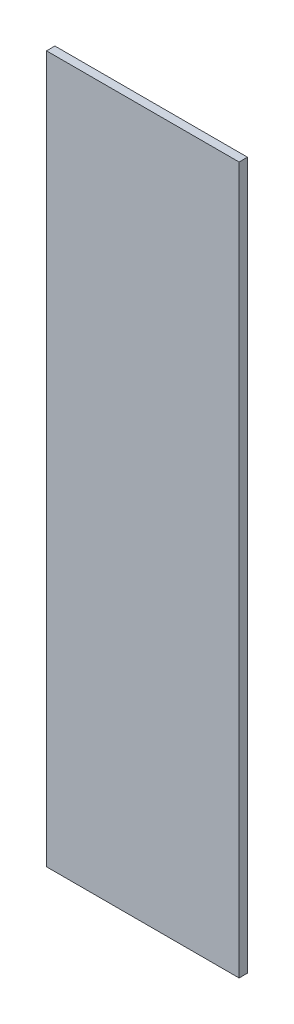
ISO-10303-21;
HEADER;
FILE_DESCRIPTION(('STEP AP214'),'2;1');
FILE_NAME('part.step','',(''),(''),'','','');
FILE_SCHEMA(('AUTOMOTIVE_DESIGN { 1 0 10303 214 1 1 1 1 }'));
ENDSEC;
DATA;
#1=APPLICATION_CONTEXT('core data for automotive mechanical design processes');
#2=APPLICATION_PROTOCOL_DEFINITION('international standard','automotive_design',2000,#1);
#3=PRODUCT_CONTEXT('',#1,'mechanical');
#4=PRODUCT('Part','Part','',(#3));
#5=PRODUCT_RELATED_PRODUCT_CATEGORY('part','',(#4));
#6=PRODUCT_DEFINITION_FORMATION('','',#4);
#7=PRODUCT_DEFINITION_CONTEXT('part definition',#1,'design');
#8=PRODUCT_DEFINITION('design','',#6,#7);
#9=PRODUCT_DEFINITION_SHAPE('','',#8);
#10=(LENGTH_UNIT() NAMED_UNIT(*) SI_UNIT(.MILLI.,.METRE.));
#11=(NAMED_UNIT(*) PLANE_ANGLE_UNIT() SI_UNIT($,.RADIAN.));
#12=(NAMED_UNIT(*) SI_UNIT($,.STERADIAN.) SOLID_ANGLE_UNIT());
#13=UNCERTAINTY_MEASURE_WITH_UNIT(LENGTH_MEASURE(1.E-05),#10,'distance_accuracy_value','');
#14=(GEOMETRIC_REPRESENTATION_CONTEXT(3) GLOBAL_UNCERTAINTY_ASSIGNED_CONTEXT((#13)) GLOBAL_UNIT_ASSIGNED_CONTEXT((#10,
#11,#12)) REPRESENTATION_CONTEXT('',''));
#15=CARTESIAN_POINT('',(0.,0.,0.));
#16=DIRECTION('',(0.,0.,1.));
#17=DIRECTION('',(1.,0.,0.));
#18=AXIS2_PLACEMENT_3D('',#15,#16,#17);
#19=CARTESIAN_POINT('',(0.,0.,3.175));
#20=DIRECTION('',(-1.,0.,0.));
#21=DIRECTION('',(0.,0.,1.));
#22=AXIS2_PLACEMENT_3D('',#19,#20,#21);
#23=PLANE('',#22);
#24=DIRECTION('',(0.,1.,0.));
#25=VECTOR('',#24,1.);
#26=CARTESIAN_POINT('',(0.,0.,0.));
#27=LINE('',#26,#25);
#28=CARTESIAN_POINT('',(0.,0.,0.));
#29=VERTEX_POINT('',#28);
#30=CARTESIAN_POINT('',(0.,267.9,0.));
#31=VERTEX_POINT('',#30);
#32=EDGE_CURVE('E102',#29,#31,#27,.T.);
#33=ORIENTED_EDGE('',*,*,#32,.T.);
#34=DIRECTION('',(0.,0.,-1.));
#35=VECTOR('',#34,1.);
#36=CARTESIAN_POINT('',(0.,267.9,3.175));
#37=LINE('',#36,#35);
#38=CARTESIAN_POINT('',(0.,267.9,3.175));
#39=VERTEX_POINT('',#38);
#40=EDGE_CURVE('E11',#39,#31,#37,.T.);
#41=ORIENTED_EDGE('',*,*,#40,.F.);
#42=DIRECTION('',(0.,1.,0.));
#43=VECTOR('',#42,1.);
#44=CARTESIAN_POINT('',(0.,0.,3.175));
#45=LINE('',#44,#43);
#46=CARTESIAN_POINT('',(0.,0.,3.175));
#47=VERTEX_POINT('',#46);
#48=EDGE_CURVE('E90',#47,#39,#45,.T.);
#49=ORIENTED_EDGE('',*,*,#48,.F.);
#50=DIRECTION('',(0.,0.,-1.));
#51=VECTOR('',#50,1.);
#52=CARTESIAN_POINT('',(0.,0.,3.175));
#53=LINE('',#52,#51);
#54=EDGE_CURVE('E98',#47,#29,#53,.T.);
#55=ORIENTED_EDGE('',*,*,#54,.T.);
#56=EDGE_LOOP('',(#33,#41,#49,#55));
#57=FACE_BOUND('',#56,.T.);
#58=ADVANCED_FACE('F39',(#57),#23,.F.);
#59=CARTESIAN_POINT('',(0.,267.9,3.175));
#60=DIRECTION('',(0.,-1.,0.));
#61=DIRECTION('',(0.,0.,-1.));
#62=AXIS2_PLACEMENT_3D('',#59,#60,#61);
#63=PLANE('',#62);
#64=DIRECTION('',(-1.,0.,0.));
#65=VECTOR('',#64,1.);
#66=CARTESIAN_POINT('',(0.,267.9,0.));
#67=LINE('',#66,#65);
#68=CARTESIAN_POINT('',(-73.,267.9,0.));
#69=VERTEX_POINT('',#68);
#70=EDGE_CURVE('E94',#31,#69,#67,.T.);
#71=ORIENTED_EDGE('',*,*,#70,.T.);
#72=DIRECTION('',(0.,0.,-1.));
#73=VECTOR('',#72,1.);
#74=CARTESIAN_POINT('',(-73.,267.9,3.175));
#75=LINE('',#74,#73);
#76=CARTESIAN_POINT('',(-73.,267.9,3.175));
#77=VERTEX_POINT('',#76);
#78=EDGE_CURVE('E47',#77,#69,#75,.T.);
#79=ORIENTED_EDGE('',*,*,#78,.F.);
#80=DIRECTION('',(-1.,0.,0.));
#81=VECTOR('',#80,1.);
#82=CARTESIAN_POINT('',(0.,267.9,3.175));
#83=LINE('',#82,#81);
#84=EDGE_CURVE('E85',#39,#77,#83,.T.);
#85=ORIENTED_EDGE('',*,*,#84,.F.);
#86=ORIENTED_EDGE('',*,*,#40,.T.);
#87=EDGE_LOOP('',(#71,#79,#85,#86));
#88=FACE_BOUND('',#87,.T.);
#89=ADVANCED_FACE('F93',(#88),#63,.F.);
#90=CARTESIAN_POINT('',(-73.,0.,3.175));
#91=DIRECTION('',(1.,0.,0.));
#92=DIRECTION('',(0.,0.,-1.));
#93=AXIS2_PLACEMENT_3D('',#90,#91,#92);
#94=PLANE('',#93);
#95=DIRECTION('',(0.,-1.,0.));
#96=VECTOR('',#95,1.);
#97=CARTESIAN_POINT('',(-73.,0.,0.));
#98=LINE('',#97,#96);
#99=CARTESIAN_POINT('',(-73.,0.,0.));
#100=VERTEX_POINT('',#99);
#101=EDGE_CURVE('E72',#69,#100,#98,.T.);
#102=ORIENTED_EDGE('',*,*,#101,.T.);
#103=DIRECTION('',(0.,0.,-1.));
#104=VECTOR('',#103,1.);
#105=CARTESIAN_POINT('',(-73.,0.,3.175));
#106=LINE('',#105,#104);
#107=CARTESIAN_POINT('',(-73.,0.,3.175));
#108=VERTEX_POINT('',#107);
#109=EDGE_CURVE('E95',#108,#100,#106,.T.);
#110=ORIENTED_EDGE('',*,*,#109,.F.);
#111=DIRECTION('',(0.,-1.,0.));
#112=VECTOR('',#111,1.);
#113=CARTESIAN_POINT('',(-73.,0.,3.175));
#114=LINE('',#113,#112);
#115=EDGE_CURVE('E88',#77,#108,#114,.T.);
#116=ORIENTED_EDGE('',*,*,#115,.F.);
#117=ORIENTED_EDGE('',*,*,#78,.T.);
#118=EDGE_LOOP('',(#102,#110,#116,#117));
#119=FACE_BOUND('',#118,.T.);
#120=ADVANCED_FACE('F96',(#119),#94,.F.);
#121=CARTESIAN_POINT('',(0.,0.,3.175));
#122=DIRECTION('',(0.,1.,0.));
#123=DIRECTION('',(-1.,0.,0.));
#124=AXIS2_PLACEMENT_3D('',#121,#122,#123);
#125=PLANE('',#124);
#126=DIRECTION('',(1.,0.,0.));
#127=VECTOR('',#126,1.);
#128=CARTESIAN_POINT('',(0.,0.,0.));
#129=LINE('',#128,#127);
#130=EDGE_CURVE('E78',#100,#29,#129,.T.);
#131=ORIENTED_EDGE('',*,*,#130,.T.);
#132=ORIENTED_EDGE('',*,*,#54,.F.);
#133=DIRECTION('',(1.,0.,0.));
#134=VECTOR('',#133,1.);
#135=CARTESIAN_POINT('',(0.,0.,3.175));
#136=LINE('',#135,#134);
#137=EDGE_CURVE('E55',#108,#47,#136,.T.);
#138=ORIENTED_EDGE('',*,*,#137,.F.);
#139=ORIENTED_EDGE('',*,*,#109,.T.);
#140=EDGE_LOOP('',(#131,#132,#138,#139));
#141=FACE_BOUND('',#140,.T.);
#142=ADVANCED_FACE('F109',(#141),#125,.F.);
#143=CARTESIAN_POINT('',(0.,0.,3.175));
#144=DIRECTION('',(0.,0.,1.));
#145=DIRECTION('',(1.,0.,0.));
#146=AXIS2_PLACEMENT_3D('',#143,#144,#145);
#147=PLANE('',#146);
#148=ORIENTED_EDGE('',*,*,#48,.T.);
#149=ORIENTED_EDGE('',*,*,#84,.T.);
#150=ORIENTED_EDGE('',*,*,#115,.T.);
#151=ORIENTED_EDGE('',*,*,#137,.T.);
#152=EDGE_LOOP('',(#148,#149,#150,#151));
#153=FACE_BOUND('',#152,.T.);
#154=ADVANCED_FACE('F86',(#153),#147,.T.);
#155=CARTESIAN_POINT('',(0.,0.,0.));
#156=DIRECTION('',(0.,0.,1.));
#157=DIRECTION('',(1.,0.,0.));
#158=AXIS2_PLACEMENT_3D('',#155,#156,#157);
#159=PLANE('',#158);
#160=ORIENTED_EDGE('',*,*,#32,.F.);
#161=ORIENTED_EDGE('',*,*,#130,.F.);
#162=ORIENTED_EDGE('',*,*,#101,.F.);
#163=ORIENTED_EDGE('',*,*,#70,.F.);
#164=EDGE_LOOP('',(#160,#161,#162,#163));
#165=FACE_BOUND('',#164,.T.);
#166=ADVANCED_FACE('F112',(#165),#159,.F.);
#167=CLOSED_SHELL('',(#58,#89,#120,#142,#154,#166));
#168=MANIFOLD_SOLID_BREP('B2',#167);
#169=ADVANCED_BREP_SHAPE_REPRESENTATION('',(#18,#168),#14);
#170=SHAPE_DEFINITION_REPRESENTATION(#9,#169);
ENDSEC;
END-ISO-10303-21;
